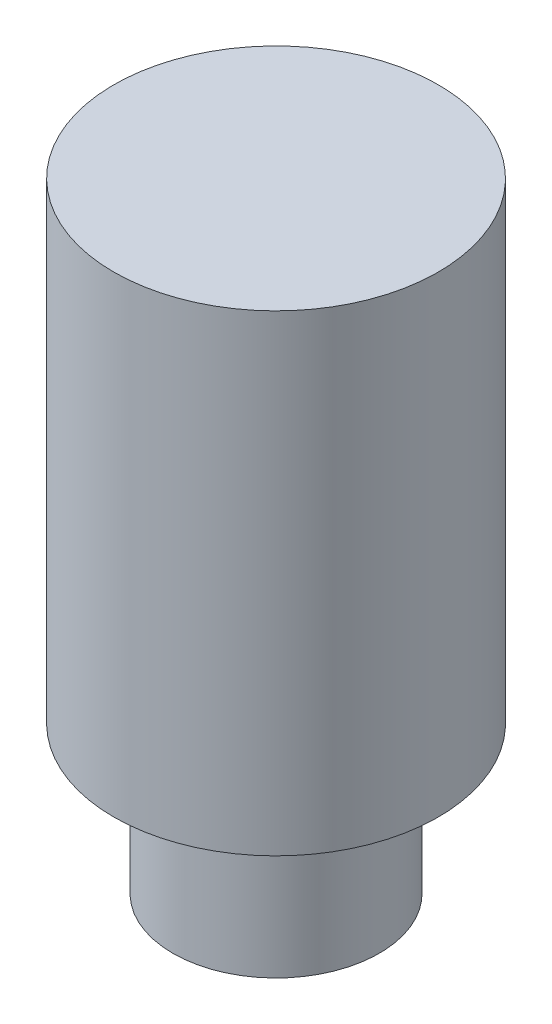
ISO-10303-21;
HEADER;
FILE_DESCRIPTION(('STEP AP214'),'2;1');
FILE_NAME('part.step','',(''),(''),'','','');
FILE_SCHEMA(('AUTOMOTIVE_DESIGN { 1 0 10303 214 1 1 1 1 }'));
ENDSEC;
DATA;
#1=APPLICATION_CONTEXT('core data for automotive mechanical design processes');
#2=APPLICATION_PROTOCOL_DEFINITION('international standard','automotive_design',2000,#1);
#3=PRODUCT_CONTEXT('',#1,'mechanical');
#4=PRODUCT('Part','Part','',(#3));
#5=PRODUCT_RELATED_PRODUCT_CATEGORY('part','',(#4));
#6=PRODUCT_DEFINITION_FORMATION('','',#4);
#7=PRODUCT_DEFINITION_CONTEXT('part definition',#1,'design');
#8=PRODUCT_DEFINITION('design','',#6,#7);
#9=PRODUCT_DEFINITION_SHAPE('','',#8);
#10=(LENGTH_UNIT() NAMED_UNIT(*) SI_UNIT(.MILLI.,.METRE.));
#11=(NAMED_UNIT(*) PLANE_ANGLE_UNIT() SI_UNIT($,.RADIAN.));
#12=(NAMED_UNIT(*) SI_UNIT($,.STERADIAN.) SOLID_ANGLE_UNIT());
#13=UNCERTAINTY_MEASURE_WITH_UNIT(LENGTH_MEASURE(1.E-05),#10,'distance_accuracy_value','');
#14=(GEOMETRIC_REPRESENTATION_CONTEXT(3) GLOBAL_UNCERTAINTY_ASSIGNED_CONTEXT((#13)) GLOBAL_UNIT_ASSIGNED_CONTEXT((#10,
#11,#12)) REPRESENTATION_CONTEXT('',''));
#15=CARTESIAN_POINT('',(0.,0.,0.));
#16=DIRECTION('',(0.,0.,1.));
#17=DIRECTION('',(1.,0.,0.));
#18=AXIS2_PLACEMENT_3D('',#15,#16,#17);
#19=CARTESIAN_POINT('',(0.,10.2858837689133,0.));
#20=DIRECTION('',(0.,-1.,0.));
#21=DIRECTION('',(0.,0.,-1.));
#22=AXIS2_PLACEMENT_3D('',#19,#20,#21);
#23=CYLINDRICAL_SURFACE('',#22,0.7875);
#24=CARTESIAN_POINT('',(0.,10.2858837689133,0.));
#25=DIRECTION('',(0.,1.,0.));
#26=DIRECTION('',(0.,0.,1.));
#27=AXIS2_PLACEMENT_3D('',#24,#25,#26);
#28=CIRCLE('',#27,0.7875);
#29=CARTESIAN_POINT('',(0.,10.2858837689133,0.7875));
#30=VERTEX_POINT('',#29);
#31=EDGE_CURVE('E10',#30,#30,#28,.T.);
#32=ORIENTED_EDGE('',*,*,#31,.F.);
#33=EDGE_LOOP('',(#32));
#34=FACE_BOUND('',#33,.T.);
#35=CARTESIAN_POINT('',(0.,9.16088376891334,0.));
#36=DIRECTION('',(0.,1.,0.));
#37=DIRECTION('',(0.,0.,1.));
#38=AXIS2_PLACEMENT_3D('',#35,#36,#37);
#39=CIRCLE('',#38,0.7875);
#40=CARTESIAN_POINT('',(0.,9.16088376891334,0.7875));
#41=VERTEX_POINT('',#40);
#42=EDGE_CURVE('E39',#41,#41,#39,.T.);
#43=ORIENTED_EDGE('',*,*,#42,.T.);
#44=EDGE_LOOP('',(#43));
#45=FACE_BOUND('',#44,.T.);
#46=ADVANCED_FACE('F36',(#34,#45),#23,.T.);
#47=CARTESIAN_POINT('',(0.,9.16088376891334,0.));
#48=DIRECTION('',(0.,1.,0.));
#49=DIRECTION('',(0.,0.,1.));
#50=AXIS2_PLACEMENT_3D('',#47,#48,#49);
#51=PLANE('',#50);
#52=ORIENTED_EDGE('',*,*,#42,.F.);
#53=EDGE_LOOP('',(#52));
#54=FACE_BOUND('',#53,.T.);
#55=ADVANCED_FACE('F63',(#54),#51,.F.);
#56=CARTESIAN_POINT('',(0.,13.8858837689133,0.));
#57=DIRECTION('',(0.,-1.,0.));
#58=DIRECTION('',(0.,0.,-1.));
#59=AXIS2_PLACEMENT_3D('',#56,#57,#58);
#60=CYLINDRICAL_SURFACE('',#59,1.2375);
#61=CARTESIAN_POINT('',(0.,13.8858837689133,0.));
#62=DIRECTION('',(0.,1.,0.));
#63=DIRECTION('',(0.,0.,1.));
#64=AXIS2_PLACEMENT_3D('',#61,#62,#63);
#65=CIRCLE('',#64,1.2375);
#66=CARTESIAN_POINT('',(0.,13.8858837689133,1.2375));
#67=VERTEX_POINT('',#66);
#68=EDGE_CURVE('E48',#67,#67,#65,.T.);
#69=ORIENTED_EDGE('',*,*,#68,.F.);
#70=EDGE_LOOP('',(#69));
#71=FACE_BOUND('',#70,.T.);
#72=CARTESIAN_POINT('',(0.,10.2858837689133,0.));
#73=DIRECTION('',(0.,1.,0.));
#74=DIRECTION('',(0.,0.,1.));
#75=AXIS2_PLACEMENT_3D('',#72,#73,#74);
#76=CIRCLE('',#75,1.2375);
#77=CARTESIAN_POINT('',(0.,10.2858837689133,1.2375));
#78=VERTEX_POINT('',#77);
#79=EDGE_CURVE('E50',#78,#78,#76,.T.);
#80=ORIENTED_EDGE('',*,*,#79,.T.);
#81=EDGE_LOOP('',(#80));
#82=FACE_BOUND('',#81,.T.);
#83=ADVANCED_FACE('F60',(#71,#82),#60,.T.);
#84=CARTESIAN_POINT('',(0.,13.8858837689133,0.));
#85=DIRECTION('',(0.,1.,0.));
#86=DIRECTION('',(0.,0.,1.));
#87=AXIS2_PLACEMENT_3D('',#84,#85,#86);
#88=PLANE('',#87);
#89=ORIENTED_EDGE('',*,*,#68,.T.);
#90=EDGE_LOOP('',(#89));
#91=FACE_BOUND('',#90,.T.);
#92=ADVANCED_FACE('F58',(#91),#88,.T.);
#93=CARTESIAN_POINT('',(0.,10.2858837689133,0.));
#94=DIRECTION('',(0.,1.,0.));
#95=DIRECTION('',(0.,0.,1.));
#96=AXIS2_PLACEMENT_3D('',#93,#94,#95);
#97=PLANE('',#96);
#98=ORIENTED_EDGE('',*,*,#31,.T.);
#99=EDGE_LOOP('',(#98));
#100=FACE_BOUND('',#99,.T.);
#101=ORIENTED_EDGE('',*,*,#79,.F.);
#102=EDGE_LOOP('',(#101));
#103=FACE_BOUND('',#102,.T.);
#104=ADVANCED_FACE('F67',(#100,#103),#97,.F.);
#105=CLOSED_SHELL('',(#46,#55,#83,#92,#104));
#106=MANIFOLD_SOLID_BREP('B2',#105);
#107=ADVANCED_BREP_SHAPE_REPRESENTATION('',(#18,#106),#14);
#108=SHAPE_DEFINITION_REPRESENTATION(#9,#107);
ENDSEC;
END-ISO-10303-21;
